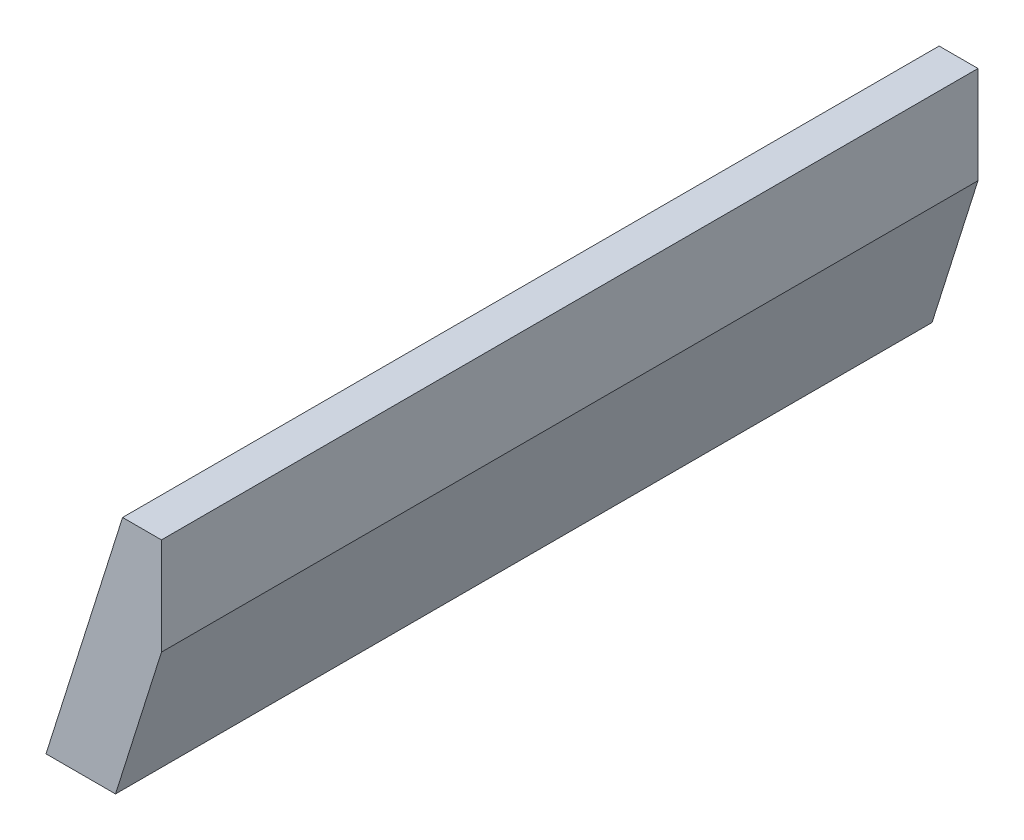
ISO-10303-21;
HEADER;
FILE_DESCRIPTION(('STEP AP214'),'2;1');
FILE_NAME('part.step','',(''),(''),'','','');
FILE_SCHEMA(('AUTOMOTIVE_DESIGN { 1 0 10303 214 1 1 1 1 }'));
ENDSEC;
DATA;
#1=APPLICATION_CONTEXT('core data for automotive mechanical design processes');
#2=APPLICATION_PROTOCOL_DEFINITION('international standard','automotive_design',2000,#1);
#3=PRODUCT_CONTEXT('',#1,'mechanical');
#4=PRODUCT('Part','Part','',(#3));
#5=PRODUCT_RELATED_PRODUCT_CATEGORY('part','',(#4));
#6=PRODUCT_DEFINITION_FORMATION('','',#4);
#7=PRODUCT_DEFINITION_CONTEXT('part definition',#1,'design');
#8=PRODUCT_DEFINITION('design','',#6,#7);
#9=PRODUCT_DEFINITION_SHAPE('','',#8);
#10=(LENGTH_UNIT() NAMED_UNIT(*) SI_UNIT(.MILLI.,.METRE.));
#11=(NAMED_UNIT(*) PLANE_ANGLE_UNIT() SI_UNIT($,.RADIAN.));
#12=(NAMED_UNIT(*) SI_UNIT($,.STERADIAN.) SOLID_ANGLE_UNIT());
#13=UNCERTAINTY_MEASURE_WITH_UNIT(LENGTH_MEASURE(1.E-05),#10,'distance_accuracy_value','');
#14=(GEOMETRIC_REPRESENTATION_CONTEXT(3) GLOBAL_UNCERTAINTY_ASSIGNED_CONTEXT((#13)) GLOBAL_UNIT_ASSIGNED_CONTEXT((#10,
#11,#12)) REPRESENTATION_CONTEXT('',''));
#15=CARTESIAN_POINT('',(0.,0.,0.));
#16=DIRECTION('',(0.,0.,1.));
#17=DIRECTION('',(1.,0.,0.));
#18=AXIS2_PLACEMENT_3D('',#15,#16,#17);
#19=CARTESIAN_POINT('',(5.44455964446059,11.9494844315091,42.));
#20=DIRECTION('',(0.,-1.,0.));
#21=DIRECTION('',(0.,0.,-1.));
#22=AXIS2_PLACEMENT_3D('',#19,#20,#21);
#23=PLANE('',#22);
#24=DIRECTION('',(-1.,0.,0.));
#25=VECTOR('',#24,1.);
#26=CARTESIAN_POINT('',(5.44455964446059,11.9494844315091,-42.));
#27=LINE('',#26,#25);
#28=CARTESIAN_POINT('',(5.44455964446059,11.9494844315091,-42.));
#29=VERTEX_POINT('',#28);
#30=CARTESIAN_POINT('',(1.44455964446059,11.9494844315091,-42.));
#31=VERTEX_POINT('',#30);
#32=EDGE_CURVE('E118',#29,#31,#27,.T.);
#33=ORIENTED_EDGE('',*,*,#32,.T.);
#34=DIRECTION('',(0.,0.,-1.));
#35=VECTOR('',#34,1.);
#36=CARTESIAN_POINT('',(1.44455964446059,11.9494844315091,42.));
#37=LINE('',#36,#35);
#38=CARTESIAN_POINT('',(1.44455964446059,11.9494844315091,42.));
#39=VERTEX_POINT('',#38);
#40=EDGE_CURVE('E11',#39,#31,#37,.T.);
#41=ORIENTED_EDGE('',*,*,#40,.F.);
#42=DIRECTION('',(-1.,0.,0.));
#43=VECTOR('',#42,1.);
#44=CARTESIAN_POINT('',(5.44455964446059,11.9494844315091,42.));
#45=LINE('',#44,#43);
#46=CARTESIAN_POINT('',(5.44455964446059,11.9494844315091,42.));
#47=VERTEX_POINT('',#46);
#48=EDGE_CURVE('E131',#47,#39,#45,.T.);
#49=ORIENTED_EDGE('',*,*,#48,.F.);
#50=DIRECTION('',(0.,0.,-1.));
#51=VECTOR('',#50,1.);
#52=CARTESIAN_POINT('',(5.44455964446059,11.9494844315091,42.));
#53=LINE('',#52,#51);
#54=EDGE_CURVE('E114',#47,#29,#53,.T.);
#55=ORIENTED_EDGE('',*,*,#54,.T.);
#56=EDGE_LOOP('',(#33,#41,#49,#55));
#57=FACE_BOUND('',#56,.T.);
#58=ADVANCED_FACE('F39',(#57),#23,.F.);
#59=CARTESIAN_POINT('',(1.44455964446059,11.9494844315091,42.));
#60=DIRECTION('',(0.953769419284832,-0.300539339915881,0.));
#61=DIRECTION('',(0.300539339915881,0.953769419284833,0.));
#62=AXIS2_PLACEMENT_3D('',#59,#60,#61);
#63=PLANE('',#62);
#64=DIRECTION('',(-0.300539339915881,-0.953769419284832,0.));
#65=VECTOR('',#64,1.);
#66=CARTESIAN_POINT('',(1.44455964446059,11.9494844315091,-42.));
#67=LINE('',#66,#65);
#68=CARTESIAN_POINT('',(-6.43311324583912,-13.0505155684909,-42.));
#69=VERTEX_POINT('',#68);
#70=EDGE_CURVE('E122',#31,#69,#67,.T.);
#71=ORIENTED_EDGE('',*,*,#70,.T.);
#72=DIRECTION('',(0.,0.,-1.));
#73=VECTOR('',#72,1.);
#74=CARTESIAN_POINT('',(-6.43311324583912,-13.0505155684909,42.));
#75=LINE('',#74,#73);
#76=CARTESIAN_POINT('',(-6.43311324583912,-13.0505155684909,42.));
#77=VERTEX_POINT('',#76);
#78=EDGE_CURVE('E48',#77,#69,#75,.T.);
#79=ORIENTED_EDGE('',*,*,#78,.F.);
#80=DIRECTION('',(-0.300539339915881,-0.953769419284832,0.));
#81=VECTOR('',#80,1.);
#82=CARTESIAN_POINT('',(1.44455964446059,11.9494844315091,42.));
#83=LINE('',#82,#81);
#84=EDGE_CURVE('E90',#39,#77,#83,.T.);
#85=ORIENTED_EDGE('',*,*,#84,.F.);
#86=ORIENTED_EDGE('',*,*,#40,.T.);
#87=EDGE_LOOP('',(#71,#79,#85,#86));
#88=FACE_BOUND('',#87,.T.);
#89=ADVANCED_FACE('F153',(#88),#63,.F.);
#90=CARTESIAN_POINT('',(-6.43311324583912,-13.0505155684909,42.));
#91=DIRECTION('',(0.,1.,0.));
#92=DIRECTION('',(0.,0.,1.));
#93=AXIS2_PLACEMENT_3D('',#90,#91,#92);
#94=PLANE('',#93);
#95=DIRECTION('',(1.,0.,0.));
#96=VECTOR('',#95,1.);
#97=CARTESIAN_POINT('',(-6.43311324583912,-13.0505155684909,-42.));
#98=LINE('',#97,#96);
#99=CARTESIAN_POINT('',(0.71795591028076,-13.0505155684909,-42.));
#100=VERTEX_POINT('',#99);
#101=EDGE_CURVE('E106',#69,#100,#98,.T.);
#102=ORIENTED_EDGE('',*,*,#101,.T.);
#103=DIRECTION('',(0.,0.,-1.));
#104=VECTOR('',#103,1.);
#105=CARTESIAN_POINT('',(0.71795591028076,-13.0505155684909,42.));
#106=LINE('',#105,#104);
#107=CARTESIAN_POINT('',(0.71795591028076,-13.0505155684909,42.));
#108=VERTEX_POINT('',#107);
#109=EDGE_CURVE('E103',#108,#100,#106,.T.);
#110=ORIENTED_EDGE('',*,*,#109,.F.);
#111=DIRECTION('',(1.,0.,0.));
#112=VECTOR('',#111,1.);
#113=CARTESIAN_POINT('',(-6.43311324583912,-13.0505155684909,42.));
#114=LINE('',#113,#112);
#115=EDGE_CURVE('E94',#77,#108,#114,.T.);
#116=ORIENTED_EDGE('',*,*,#115,.F.);
#117=ORIENTED_EDGE('',*,*,#78,.T.);
#118=EDGE_LOOP('',(#102,#110,#116,#117));
#119=FACE_BOUND('',#118,.T.);
#120=ADVANCED_FACE('F104',(#119),#94,.F.);
#121=CARTESIAN_POINT('',(5.44455964446059,1.94948443150911,42.));
#122=DIRECTION('',(-0.953769419284832,0.300539339915881,0.));
#123=DIRECTION('',(-0.300539339915881,-0.953769419284833,0.));
#124=AXIS2_PLACEMENT_3D('',#121,#122,#123);
#125=PLANE('',#124);
#126=DIRECTION('',(0.300539339915881,0.953769419284832,0.));
#127=VECTOR('',#126,1.);
#128=CARTESIAN_POINT('',(5.44455964446059,1.94948443150911,-42.));
#129=LINE('',#128,#127);
#130=CARTESIAN_POINT('',(5.44455964446059,1.94948443150911,-42.));
#131=VERTEX_POINT('',#130);
#132=EDGE_CURVE('E76',#100,#131,#129,.T.);
#133=ORIENTED_EDGE('',*,*,#132,.T.);
#134=DIRECTION('',(0.,0.,-1.));
#135=VECTOR('',#134,1.);
#136=CARTESIAN_POINT('',(5.44455964446059,1.94948443150911,42.));
#137=LINE('',#136,#135);
#138=CARTESIAN_POINT('',(5.44455964446059,1.94948443150911,42.));
#139=VERTEX_POINT('',#138);
#140=EDGE_CURVE('E108',#139,#131,#137,.T.);
#141=ORIENTED_EDGE('',*,*,#140,.F.);
#142=DIRECTION('',(0.300539339915881,0.953769419284832,0.));
#143=VECTOR('',#142,1.);
#144=CARTESIAN_POINT('',(5.44455964446059,1.94948443150911,42.));
#145=LINE('',#144,#143);
#146=EDGE_CURVE('E98',#108,#139,#145,.T.);
#147=ORIENTED_EDGE('',*,*,#146,.F.);
#148=ORIENTED_EDGE('',*,*,#109,.T.);
#149=EDGE_LOOP('',(#133,#141,#147,#148));
#150=FACE_BOUND('',#149,.T.);
#151=ADVANCED_FACE('F110',(#150),#125,.F.);
#152=CARTESIAN_POINT('',(5.44455964446059,11.9494844315091,42.));
#153=DIRECTION('',(-1.,0.,0.));
#154=DIRECTION('',(0.,-1.,0.));
#155=AXIS2_PLACEMENT_3D('',#152,#153,#154);
#156=PLANE('',#155);
#157=DIRECTION('',(0.,1.,0.));
#158=VECTOR('',#157,1.);
#159=CARTESIAN_POINT('',(5.44455964446059,11.9494844315091,-42.));
#160=LINE('',#159,#158);
#161=EDGE_CURVE('E82',#131,#29,#160,.T.);
#162=ORIENTED_EDGE('',*,*,#161,.T.);
#163=ORIENTED_EDGE('',*,*,#54,.F.);
#164=DIRECTION('',(0.,1.,0.));
#165=VECTOR('',#164,1.);
#166=CARTESIAN_POINT('',(5.44455964446059,11.9494844315091,42.));
#167=LINE('',#166,#165);
#168=EDGE_CURVE('E56',#139,#47,#167,.T.);
#169=ORIENTED_EDGE('',*,*,#168,.F.);
#170=ORIENTED_EDGE('',*,*,#140,.T.);
#171=EDGE_LOOP('',(#162,#163,#169,#170));
#172=FACE_BOUND('',#171,.T.);
#173=ADVANCED_FACE('F142',(#172),#156,.F.);
#174=CARTESIAN_POINT('',(0.,0.,42.));
#175=DIRECTION('',(0.,0.,1.));
#176=DIRECTION('',(1.,0.,0.));
#177=AXIS2_PLACEMENT_3D('',#174,#175,#176);
#178=PLANE('',#177);
#179=ORIENTED_EDGE('',*,*,#48,.T.);
#180=ORIENTED_EDGE('',*,*,#84,.T.);
#181=ORIENTED_EDGE('',*,*,#115,.T.);
#182=ORIENTED_EDGE('',*,*,#146,.T.);
#183=ORIENTED_EDGE('',*,*,#168,.T.);
#184=EDGE_LOOP('',(#179,#180,#181,#182,#183));
#185=FACE_BOUND('',#184,.T.);
#186=ADVANCED_FACE('F96',(#185),#178,.T.);
#187=CARTESIAN_POINT('',(0.,0.,-42.));
#188=DIRECTION('',(0.,0.,1.));
#189=DIRECTION('',(1.,0.,0.));
#190=AXIS2_PLACEMENT_3D('',#187,#188,#189);
#191=PLANE('',#190);
#192=ORIENTED_EDGE('',*,*,#32,.F.);
#193=ORIENTED_EDGE('',*,*,#161,.F.);
#194=ORIENTED_EDGE('',*,*,#132,.F.);
#195=ORIENTED_EDGE('',*,*,#101,.F.);
#196=ORIENTED_EDGE('',*,*,#70,.F.);
#197=EDGE_LOOP('',(#192,#193,#194,#195,#196));
#198=FACE_BOUND('',#197,.T.);
#199=ADVANCED_FACE('F138',(#198),#191,.F.);
#200=CLOSED_SHELL('',(#58,#89,#120,#151,#173,#186,#199));
#201=MANIFOLD_SOLID_BREP('B2',#200);
#202=ADVANCED_BREP_SHAPE_REPRESENTATION('',(#18,#201),#14);
#203=SHAPE_DEFINITION_REPRESENTATION(#9,#202);
ENDSEC;
END-ISO-10303-21;
